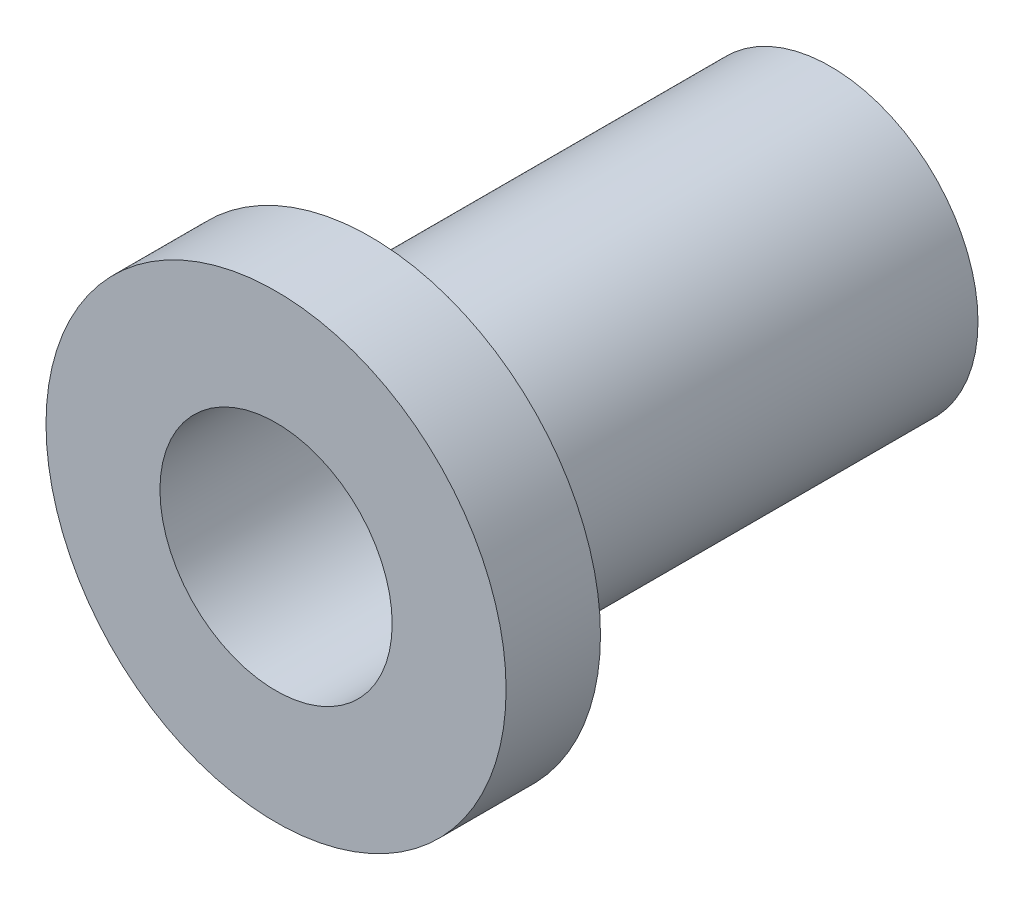
ISO-10303-21;
HEADER;
FILE_DESCRIPTION(('STEP AP214'),'2;1');
FILE_NAME('part.step','',(''),(''),'','','');
FILE_SCHEMA(('AUTOMOTIVE_DESIGN { 1 0 10303 214 1 1 1 1 }'));
ENDSEC;
DATA;
#1=APPLICATION_CONTEXT('core data for automotive mechanical design processes');
#2=APPLICATION_PROTOCOL_DEFINITION('international standard','automotive_design',2000,#1);
#3=PRODUCT_CONTEXT('',#1,'mechanical');
#4=PRODUCT('Part','Part','',(#3));
#5=PRODUCT_RELATED_PRODUCT_CATEGORY('part','',(#4));
#6=PRODUCT_DEFINITION_FORMATION('','',#4);
#7=PRODUCT_DEFINITION_CONTEXT('part definition',#1,'design');
#8=PRODUCT_DEFINITION('design','',#6,#7);
#9=PRODUCT_DEFINITION_SHAPE('','',#8);
#10=(LENGTH_UNIT() NAMED_UNIT(*) SI_UNIT(.MILLI.,.METRE.));
#11=(NAMED_UNIT(*) PLANE_ANGLE_UNIT() SI_UNIT($,.RADIAN.));
#12=(NAMED_UNIT(*) SI_UNIT($,.STERADIAN.) SOLID_ANGLE_UNIT());
#13=UNCERTAINTY_MEASURE_WITH_UNIT(LENGTH_MEASURE(1.E-05),#10,'distance_accuracy_value','');
#14=(GEOMETRIC_REPRESENTATION_CONTEXT(3) GLOBAL_UNCERTAINTY_ASSIGNED_CONTEXT((#13)) GLOBAL_UNIT_ASSIGNED_CONTEXT((#10,
#11,#12)) REPRESENTATION_CONTEXT('',''));
#15=CARTESIAN_POINT('',(0.,0.,0.));
#16=DIRECTION('',(0.,0.,1.));
#17=DIRECTION('',(1.,0.,0.));
#18=AXIS2_PLACEMENT_3D('',#15,#16,#17);
#19=CARTESIAN_POINT('',(0.,0.,2.032));
#20=DIRECTION('',(0.,0.,1.));
#21=DIRECTION('',(1.,0.,0.));
#22=AXIS2_PLACEMENT_3D('',#19,#20,#21);
#23=PLANE('',#22);
#24=CARTESIAN_POINT('',(0.,0.,2.032));
#25=DIRECTION('',(0.,0.,-1.));
#26=DIRECTION('',(-1.,0.,0.));
#27=AXIS2_PLACEMENT_3D('',#24,#25,#26);
#28=CIRCLE('',#27,2.5);
#29=CARTESIAN_POINT('',(-2.5,0.,2.032));
#30=VERTEX_POINT('',#29);
#31=EDGE_CURVE('E15',#30,#30,#28,.T.);
#32=ORIENTED_EDGE('',*,*,#31,.T.);
#33=EDGE_LOOP('',(#32));
#34=FACE_BOUND('',#33,.T.);
#35=CARTESIAN_POINT('',(0.,0.,2.032));
#36=DIRECTION('',(0.,0.,-1.));
#37=DIRECTION('',(-1.,0.,0.));
#38=AXIS2_PLACEMENT_3D('',#35,#36,#37);
#39=CIRCLE('',#38,4.953);
#40=CARTESIAN_POINT('',(-4.953,0.,2.032));
#41=VERTEX_POINT('',#40);
#42=EDGE_CURVE('E31',#41,#41,#39,.T.);
#43=ORIENTED_EDGE('',*,*,#42,.F.);
#44=EDGE_LOOP('',(#43));
#45=FACE_BOUND('',#44,.T.);
#46=ADVANCED_FACE('F12',(#34,#45),#23,.T.);
#47=CARTESIAN_POINT('',(0.,0.,2.032));
#48=DIRECTION('',(0.,0.,-1.));
#49=DIRECTION('',(-1.,0.,0.));
#50=AXIS2_PLACEMENT_3D('',#47,#48,#49);
#51=CYLINDRICAL_SURFACE('',#50,2.5);
#52=CARTESIAN_POINT('',(0.,0.,-9.906));
#53=DIRECTION('',(0.,0.,-1.));
#54=DIRECTION('',(-1.,0.,0.));
#55=AXIS2_PLACEMENT_3D('',#52,#53,#54);
#56=CIRCLE('',#55,2.5);
#57=CARTESIAN_POINT('',(-2.5,0.,-9.906));
#58=VERTEX_POINT('',#57);
#59=EDGE_CURVE('E29',#58,#58,#56,.F.);
#60=ORIENTED_EDGE('',*,*,#59,.F.);
#61=EDGE_LOOP('',(#60));
#62=FACE_BOUND('',#61,.T.);
#63=ORIENTED_EDGE('',*,*,#31,.F.);
#64=EDGE_LOOP('',(#63));
#65=FACE_BOUND('',#64,.T.);
#66=ADVANCED_FACE('F40',(#62,#65),#51,.F.);
#67=CARTESIAN_POINT('',(0.,0.,2.032));
#68=DIRECTION('',(0.,0.,-1.));
#69=DIRECTION('',(-1.,0.,0.));
#70=AXIS2_PLACEMENT_3D('',#67,#68,#69);
#71=CYLINDRICAL_SURFACE('',#70,4.953);
#72=ORIENTED_EDGE('',*,*,#42,.T.);
#73=EDGE_LOOP('',(#72));
#74=FACE_BOUND('',#73,.T.);
#75=CARTESIAN_POINT('',(0.,0.,0.));
#76=DIRECTION('',(0.,0.,-1.));
#77=DIRECTION('',(-1.,0.,0.));
#78=AXIS2_PLACEMENT_3D('',#75,#76,#77);
#79=CIRCLE('',#78,4.953);
#80=CARTESIAN_POINT('',(-4.953,0.,0.));
#81=VERTEX_POINT('',#80);
#82=EDGE_CURVE('E24',#81,#81,#79,.F.);
#83=ORIENTED_EDGE('',*,*,#82,.T.);
#84=EDGE_LOOP('',(#83));
#85=FACE_BOUND('',#84,.T.);
#86=ADVANCED_FACE('F42',(#74,#85),#71,.T.);
#87=CARTESIAN_POINT('',(0.,0.,-9.906));
#88=DIRECTION('',(0.,0.,-1.));
#89=DIRECTION('',(-1.,0.,0.));
#90=AXIS2_PLACEMENT_3D('',#87,#88,#89);
#91=PLANE('',#90);
#92=ORIENTED_EDGE('',*,*,#59,.T.);
#93=EDGE_LOOP('',(#92));
#94=FACE_BOUND('',#93,.T.);
#95=CARTESIAN_POINT('',(0.,0.,-9.906));
#96=DIRECTION('',(0.,0.,1.));
#97=DIRECTION('',(1.,0.,0.));
#98=AXIS2_PLACEMENT_3D('',#95,#96,#97);
#99=CIRCLE('',#98,3.175);
#100=CARTESIAN_POINT('',(3.175,0.,-9.906));
#101=VERTEX_POINT('',#100);
#102=EDGE_CURVE('E19',#101,#101,#99,.T.);
#103=ORIENTED_EDGE('',*,*,#102,.F.);
#104=EDGE_LOOP('',(#103));
#105=FACE_BOUND('',#104,.T.);
#106=ADVANCED_FACE('F49',(#94,#105),#91,.T.);
#107=CARTESIAN_POINT('',(0.,0.,0.));
#108=DIRECTION('',(0.,0.,1.));
#109=DIRECTION('',(1.,0.,0.));
#110=AXIS2_PLACEMENT_3D('',#107,#108,#109);
#111=PLANE('',#110);
#112=CARTESIAN_POINT('',(0.,0.,0.));
#113=DIRECTION('',(0.,0.,1.));
#114=DIRECTION('',(1.,0.,0.));
#115=AXIS2_PLACEMENT_3D('',#112,#113,#114);
#116=CIRCLE('',#115,3.175);
#117=CARTESIAN_POINT('',(3.175,0.,0.));
#118=VERTEX_POINT('',#117);
#119=EDGE_CURVE('E8',#118,#118,#116,.F.);
#120=ORIENTED_EDGE('',*,*,#119,.F.);
#121=EDGE_LOOP('',(#120));
#122=FACE_BOUND('',#121,.T.);
#123=ORIENTED_EDGE('',*,*,#82,.F.);
#124=EDGE_LOOP('',(#123));
#125=FACE_BOUND('',#124,.T.);
#126=ADVANCED_FACE('F54',(#122,#125),#111,.F.);
#127=CARTESIAN_POINT('',(0.,0.,-9.906));
#128=DIRECTION('',(0.,0.,1.));
#129=DIRECTION('',(1.,0.,0.));
#130=AXIS2_PLACEMENT_3D('',#127,#128,#129);
#131=CYLINDRICAL_SURFACE('',#130,3.175);
#132=ORIENTED_EDGE('',*,*,#119,.T.);
#133=EDGE_LOOP('',(#132));
#134=FACE_BOUND('',#133,.T.);
#135=ORIENTED_EDGE('',*,*,#102,.T.);
#136=EDGE_LOOP('',(#135));
#137=FACE_BOUND('',#136,.T.);
#138=ADVANCED_FACE('F52',(#134,#137),#131,.T.);
#139=CLOSED_SHELL('',(#46,#66,#86,#106,#126,#138));
#140=MANIFOLD_SOLID_BREP('B1',#139);
#141=ADVANCED_BREP_SHAPE_REPRESENTATION('',(#18,#140),#14);
#142=SHAPE_DEFINITION_REPRESENTATION(#9,#141);
ENDSEC;
END-ISO-10303-21;
